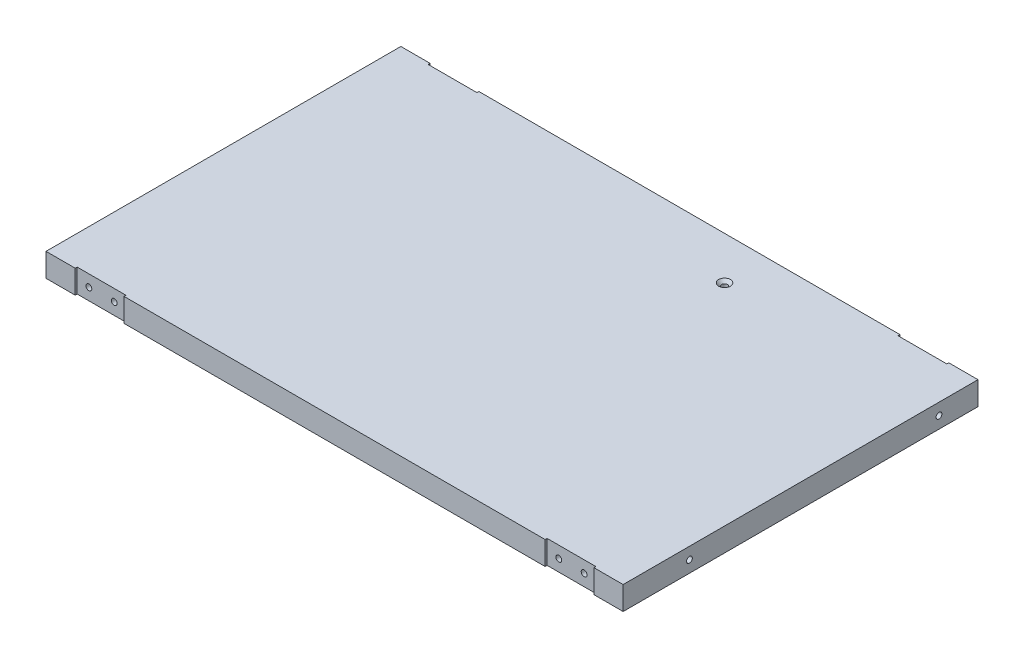
ISO-10303-21;
HEADER;
FILE_DESCRIPTION(('STEP AP214'),'2;1');
FILE_NAME('part.step','',(''),(''),'','','');
FILE_SCHEMA(('AUTOMOTIVE_DESIGN { 1 0 10303 214 1 1 1 1 }'));
ENDSEC;
DATA;
#1=APPLICATION_CONTEXT('core data for automotive mechanical design processes');
#2=APPLICATION_PROTOCOL_DEFINITION('international standard','automotive_design',2000,#1);
#3=PRODUCT_CONTEXT('',#1,'mechanical');
#4=PRODUCT('Part','Part','',(#3));
#5=PRODUCT_RELATED_PRODUCT_CATEGORY('part','',(#4));
#6=PRODUCT_DEFINITION_FORMATION('','',#4);
#7=PRODUCT_DEFINITION_CONTEXT('part definition',#1,'design');
#8=PRODUCT_DEFINITION('design','',#6,#7);
#9=PRODUCT_DEFINITION_SHAPE('','',#8);
#10=(LENGTH_UNIT() NAMED_UNIT(*) SI_UNIT(.MILLI.,.METRE.));
#11=(NAMED_UNIT(*) PLANE_ANGLE_UNIT() SI_UNIT($,.RADIAN.));
#12=(NAMED_UNIT(*) SI_UNIT($,.STERADIAN.) SOLID_ANGLE_UNIT());
#13=UNCERTAINTY_MEASURE_WITH_UNIT(LENGTH_MEASURE(1.E-05),#10,'distance_accuracy_value','');
#14=(GEOMETRIC_REPRESENTATION_CONTEXT(3) GLOBAL_UNCERTAINTY_ASSIGNED_CONTEXT((#13)) GLOBAL_UNIT_ASSIGNED_CONTEXT((#10,
#11,#12)) REPRESENTATION_CONTEXT('',''));
#15=CARTESIAN_POINT('',(0.,0.,0.));
#16=DIRECTION('',(0.,0.,1.));
#17=DIRECTION('',(1.,0.,0.));
#18=AXIS2_PLACEMENT_3D('',#15,#16,#17);
#19=CARTESIAN_POINT('',(0.,12.,0.));
#20=DIRECTION('',(0.,-1.,0.));
#21=DIRECTION('',(0.,0.,-1.));
#22=AXIS2_PLACEMENT_3D('',#19,#20,#21);
#23=PLANE('',#22);
#24=CARTESIAN_POINT('',(188.,12.,-160.));
#25=DIRECTION('',(0.,-1.,0.));
#26=DIRECTION('',(0.,0.,-1.));
#27=AXIS2_PLACEMENT_3D('',#24,#25,#26);
#28=CIRCLE('',#27,2.99999999999999);
#29=CARTESIAN_POINT('',(188.,12.,-163.));
#30=VERTEX_POINT('',#29);
#31=EDGE_CURVE('E325',#30,#30,#28,.T.);
#32=ORIENTED_EDGE('',*,*,#31,.T.);
#33=EDGE_LOOP('',(#32));
#34=FACE_BOUND('',#33,.T.);
#35=DIRECTION('',(0.,0.,-1.));
#36=VECTOR('',#35,1.);
#37=CARTESIAN_POINT('',(281.,12.,-181.));
#38=LINE('',#37,#36);
#39=CARTESIAN_POINT('',(281.,12.,-181.));
#40=VERTEX_POINT('',#39);
#41=CARTESIAN_POINT('',(281.,12.,-182.));
#42=VERTEX_POINT('',#41);
#43=EDGE_CURVE('E192',#40,#42,#38,.T.);
#44=ORIENTED_EDGE('',*,*,#43,.F.);
#45=DIRECTION('',(-1.,0.,0.));
#46=VECTOR('',#45,1.);
#47=CARTESIAN_POINT('',(0.,12.,-181.));
#48=LINE('',#47,#46);
#49=CARTESIAN_POINT('',(256.,12.,-181.));
#50=VERTEX_POINT('',#49);
#51=EDGE_CURVE('E180',#40,#50,#48,.T.);
#52=ORIENTED_EDGE('',*,*,#51,.T.);
#53=DIRECTION('',(0.,0.,-1.));
#54=VECTOR('',#53,1.);
#55=CARTESIAN_POINT('',(256.,12.,-181.));
#56=LINE('',#55,#54);
#57=CARTESIAN_POINT('',(256.,12.,-182.));
#58=VERTEX_POINT('',#57);
#59=EDGE_CURVE('E205',#50,#58,#56,.T.);
#60=ORIENTED_EDGE('',*,*,#59,.T.);
#61=DIRECTION('',(-1.,0.,0.));
#62=VECTOR('',#61,1.);
#63=CARTESIAN_POINT('',(0.,12.,-182.));
#64=LINE('',#63,#62);
#65=CARTESIAN_POINT('',(40.,12.,-182.));
#66=VERTEX_POINT('',#65);
#67=EDGE_CURVE('E57',#58,#66,#64,.T.);
#68=ORIENTED_EDGE('',*,*,#67,.T.);
#69=DIRECTION('',(0.,0.,-1.));
#70=VECTOR('',#69,1.);
#71=CARTESIAN_POINT('',(40.,12.,-181.));
#72=LINE('',#71,#70);
#73=CARTESIAN_POINT('',(40.,12.,-181.));
#74=VERTEX_POINT('',#73);
#75=EDGE_CURVE('E223',#74,#66,#72,.T.);
#76=ORIENTED_EDGE('',*,*,#75,.F.);
#77=DIRECTION('',(-1.,0.,0.));
#78=VECTOR('',#77,1.);
#79=CARTESIAN_POINT('',(0.,12.,-181.));
#80=LINE('',#79,#78);
#81=CARTESIAN_POINT('',(15.,12.,-181.));
#82=VERTEX_POINT('',#81);
#83=EDGE_CURVE('E212',#74,#82,#80,.T.);
#84=ORIENTED_EDGE('',*,*,#83,.T.);
#85=DIRECTION('',(0.,0.,-1.));
#86=VECTOR('',#85,1.);
#87=CARTESIAN_POINT('',(15.,12.,-181.));
#88=LINE('',#87,#86);
#89=CARTESIAN_POINT('',(15.,12.,-182.));
#90=VERTEX_POINT('',#89);
#91=EDGE_CURVE('E234',#82,#90,#88,.T.);
#92=ORIENTED_EDGE('',*,*,#91,.T.);
#93=CARTESIAN_POINT('',(0.,12.,-182.));
#94=VERTEX_POINT('',#93);
#95=EDGE_CURVE('E368',#90,#94,#64,.T.);
#96=ORIENTED_EDGE('',*,*,#95,.T.);
#97=DIRECTION('',(0.,0.,1.));
#98=VECTOR('',#97,1.);
#99=CARTESIAN_POINT('',(0.,12.,0.));
#100=LINE('',#99,#98);
#101=CARTESIAN_POINT('',(0.,12.,0.));
#102=VERTEX_POINT('',#101);
#103=EDGE_CURVE('E357',#94,#102,#100,.T.);
#104=ORIENTED_EDGE('',*,*,#103,.T.);
#105=DIRECTION('',(1.,0.,0.));
#106=VECTOR('',#105,1.);
#107=CARTESIAN_POINT('',(0.,12.,0.));
#108=LINE('',#107,#106);
#109=CARTESIAN_POINT('',(15.,12.,0.));
#110=VERTEX_POINT('',#109);
#111=EDGE_CURVE('E362',#102,#110,#108,.T.);
#112=ORIENTED_EDGE('',*,*,#111,.T.);
#113=DIRECTION('',(0.,0.,1.));
#114=VECTOR('',#113,1.);
#115=CARTESIAN_POINT('',(15.,12.,-1.));
#116=LINE('',#115,#114);
#117=CARTESIAN_POINT('',(15.,12.,-1.));
#118=VERTEX_POINT('',#117);
#119=EDGE_CURVE('E288',#118,#110,#116,.T.);
#120=ORIENTED_EDGE('',*,*,#119,.F.);
#121=DIRECTION('',(-1.,0.,0.));
#122=VECTOR('',#121,1.);
#123=CARTESIAN_POINT('',(15.,12.,-1.));
#124=LINE('',#123,#122);
#125=CARTESIAN_POINT('',(40.,12.,-1.));
#126=VERTEX_POINT('',#125);
#127=EDGE_CURVE('E282',#126,#118,#124,.T.);
#128=ORIENTED_EDGE('',*,*,#127,.F.);
#129=DIRECTION('',(0.,0.,1.));
#130=VECTOR('',#129,1.);
#131=CARTESIAN_POINT('',(40.,12.,-1.));
#132=LINE('',#131,#130);
#133=CARTESIAN_POINT('',(40.,12.,0.));
#134=VERTEX_POINT('',#133);
#135=EDGE_CURVE('E291',#126,#134,#132,.T.);
#136=ORIENTED_EDGE('',*,*,#135,.T.);
#137=CARTESIAN_POINT('',(256.,12.,0.));
#138=VERTEX_POINT('',#137);
#139=EDGE_CURVE('E366',#134,#138,#108,.T.);
#140=ORIENTED_EDGE('',*,*,#139,.T.);
#141=DIRECTION('',(0.,0.,1.));
#142=VECTOR('',#141,1.);
#143=CARTESIAN_POINT('',(256.,12.,-1.));
#144=LINE('',#143,#142);
#145=CARTESIAN_POINT('',(256.,12.,-1.));
#146=VERTEX_POINT('',#145);
#147=EDGE_CURVE('E264',#146,#138,#144,.T.);
#148=ORIENTED_EDGE('',*,*,#147,.F.);
#149=DIRECTION('',(-1.,0.,0.));
#150=VECTOR('',#149,1.);
#151=CARTESIAN_POINT('',(281.,12.,-1.));
#152=LINE('',#151,#150);
#153=CARTESIAN_POINT('',(281.,12.,-1.));
#154=VERTEX_POINT('',#153);
#155=EDGE_CURVE('E245',#154,#146,#152,.T.);
#156=ORIENTED_EDGE('',*,*,#155,.F.);
#157=DIRECTION('',(0.,0.,1.));
#158=VECTOR('',#157,1.);
#159=CARTESIAN_POINT('',(281.,12.,-1.));
#160=LINE('',#159,#158);
#161=CARTESIAN_POINT('',(281.,12.,0.));
#162=VERTEX_POINT('',#161);
#163=EDGE_CURVE('E255',#154,#162,#160,.T.);
#164=ORIENTED_EDGE('',*,*,#163,.T.);
#165=CARTESIAN_POINT('',(296.,12.,0.));
#166=VERTEX_POINT('',#165);
#167=EDGE_CURVE('E360',#162,#166,#108,.T.);
#168=ORIENTED_EDGE('',*,*,#167,.T.);
#169=DIRECTION('',(0.,0.,-1.));
#170=VECTOR('',#169,1.);
#171=CARTESIAN_POINT('',(296.,12.,0.));
#172=LINE('',#171,#170);
#173=CARTESIAN_POINT('',(296.,12.,-182.));
#174=VERTEX_POINT('',#173);
#175=EDGE_CURVE('E365',#166,#174,#172,.T.);
#176=ORIENTED_EDGE('',*,*,#175,.T.);
#177=EDGE_CURVE('E369',#174,#42,#64,.T.);
#178=ORIENTED_EDGE('',*,*,#177,.T.);
#179=EDGE_LOOP('',(#44,#52,#60,#68,#76,#84,#92,#96,#104,#112,#120,#128,#136,#140,#148,#156,#164,
#168,#176,#178));
#180=FACE_BOUND('',#179,.T.);
#181=ADVANCED_FACE('F32',(#34,#180),#23,.F.);
#182=CARTESIAN_POINT('',(0.,0.,0.));
#183=DIRECTION('',(0.,-1.,0.));
#184=DIRECTION('',(0.,0.,-1.));
#185=AXIS2_PLACEMENT_3D('',#182,#183,#184);
#186=PLANE('',#185);
#187=CARTESIAN_POINT('',(188.,0.,-160.));
#188=DIRECTION('',(0.,1.,0.));
#189=DIRECTION('',(0.,0.,1.));
#190=AXIS2_PLACEMENT_3D('',#187,#188,#189);
#191=CIRCLE('',#190,1.5);
#192=CARTESIAN_POINT('',(188.,0.,-158.5));
#193=VERTEX_POINT('',#192);
#194=EDGE_CURVE('E351',#193,#193,#191,.T.);
#195=ORIENTED_EDGE('',*,*,#194,.T.);
#196=EDGE_LOOP('',(#195));
#197=FACE_BOUND('',#196,.T.);
#198=DIRECTION('',(1.,0.,0.));
#199=VECTOR('',#198,1.);
#200=CARTESIAN_POINT('',(0.,0.,-181.));
#201=LINE('',#200,#199);
#202=CARTESIAN_POINT('',(256.,0.,-181.));
#203=VERTEX_POINT('',#202);
#204=CARTESIAN_POINT('',(281.,0.,-181.));
#205=VERTEX_POINT('',#204);
#206=EDGE_CURVE('E178',#203,#205,#201,.T.);
#207=ORIENTED_EDGE('',*,*,#206,.T.);
#208=DIRECTION('',(0.,0.,-1.));
#209=VECTOR('',#208,1.);
#210=CARTESIAN_POINT('',(281.,0.,-181.));
#211=LINE('',#210,#209);
#212=CARTESIAN_POINT('',(281.,0.,-182.));
#213=VERTEX_POINT('',#212);
#214=EDGE_CURVE('E185',#205,#213,#211,.T.);
#215=ORIENTED_EDGE('',*,*,#214,.T.);
#216=DIRECTION('',(-1.,0.,0.));
#217=VECTOR('',#216,1.);
#218=CARTESIAN_POINT('',(0.,0.,-182.));
#219=LINE('',#218,#217);
#220=CARTESIAN_POINT('',(296.,0.,-182.));
#221=VERTEX_POINT('',#220);
#222=EDGE_CURVE('E361',#221,#213,#219,.T.);
#223=ORIENTED_EDGE('',*,*,#222,.F.);
#224=DIRECTION('',(0.,0.,-1.));
#225=VECTOR('',#224,1.);
#226=CARTESIAN_POINT('',(296.,0.,0.));
#227=LINE('',#226,#225);
#228=CARTESIAN_POINT('',(296.,0.,0.));
#229=VERTEX_POINT('',#228);
#230=EDGE_CURVE('E379',#229,#221,#227,.T.);
#231=ORIENTED_EDGE('',*,*,#230,.F.);
#232=DIRECTION('',(1.,0.,0.));
#233=VECTOR('',#232,1.);
#234=CARTESIAN_POINT('',(0.,0.,0.));
#235=LINE('',#234,#233);
#236=CARTESIAN_POINT('',(281.,0.,0.));
#237=VERTEX_POINT('',#236);
#238=EDGE_CURVE('E375',#237,#229,#235,.T.);
#239=ORIENTED_EDGE('',*,*,#238,.F.);
#240=DIRECTION('',(0.,0.,1.));
#241=VECTOR('',#240,1.);
#242=CARTESIAN_POINT('',(281.,0.,-1.));
#243=LINE('',#242,#241);
#244=CARTESIAN_POINT('',(281.,0.,-1.));
#245=VERTEX_POINT('',#244);
#246=EDGE_CURVE('E258',#245,#237,#243,.T.);
#247=ORIENTED_EDGE('',*,*,#246,.F.);
#248=DIRECTION('',(1.,0.,0.));
#249=VECTOR('',#248,1.);
#250=CARTESIAN_POINT('',(281.,0.,-1.));
#251=LINE('',#250,#249);
#252=CARTESIAN_POINT('',(256.,0.,-1.));
#253=VERTEX_POINT('',#252);
#254=EDGE_CURVE('E252',#253,#245,#251,.T.);
#255=ORIENTED_EDGE('',*,*,#254,.F.);
#256=DIRECTION('',(0.,0.,1.));
#257=VECTOR('',#256,1.);
#258=CARTESIAN_POINT('',(256.,0.,-1.));
#259=LINE('',#258,#257);
#260=CARTESIAN_POINT('',(256.,0.,0.));
#261=VERTEX_POINT('',#260);
#262=EDGE_CURVE('E261',#253,#261,#259,.T.);
#263=ORIENTED_EDGE('',*,*,#262,.T.);
#264=CARTESIAN_POINT('',(40.,0.,0.));
#265=VERTEX_POINT('',#264);
#266=EDGE_CURVE('E380',#265,#261,#235,.T.);
#267=ORIENTED_EDGE('',*,*,#266,.F.);
#268=DIRECTION('',(0.,0.,1.));
#269=VECTOR('',#268,1.);
#270=CARTESIAN_POINT('',(40.,0.,-1.));
#271=LINE('',#270,#269);
#272=CARTESIAN_POINT('',(40.,0.,-1.));
#273=VERTEX_POINT('',#272);
#274=EDGE_CURVE('E294',#273,#265,#271,.T.);
#275=ORIENTED_EDGE('',*,*,#274,.F.);
#276=DIRECTION('',(1.,0.,0.));
#277=VECTOR('',#276,1.);
#278=CARTESIAN_POINT('',(15.,0.,-1.));
#279=LINE('',#278,#277);
#280=CARTESIAN_POINT('',(15.,0.,-1.));
#281=VERTEX_POINT('',#280);
#282=EDGE_CURVE('E275',#281,#273,#279,.T.);
#283=ORIENTED_EDGE('',*,*,#282,.F.);
#284=DIRECTION('',(0.,0.,1.));
#285=VECTOR('',#284,1.);
#286=CARTESIAN_POINT('',(15.,0.,-1.));
#287=LINE('',#286,#285);
#288=CARTESIAN_POINT('',(15.,0.,0.));
#289=VERTEX_POINT('',#288);
#290=EDGE_CURVE('E285',#281,#289,#287,.T.);
#291=ORIENTED_EDGE('',*,*,#290,.T.);
#292=CARTESIAN_POINT('',(0.,0.,0.));
#293=VERTEX_POINT('',#292);
#294=EDGE_CURVE('E376',#293,#289,#235,.T.);
#295=ORIENTED_EDGE('',*,*,#294,.F.);
#296=DIRECTION('',(0.,0.,1.));
#297=VECTOR('',#296,1.);
#298=CARTESIAN_POINT('',(0.,0.,0.));
#299=LINE('',#298,#297);
#300=CARTESIAN_POINT('',(0.,0.,-182.));
#301=VERTEX_POINT('',#300);
#302=EDGE_CURVE('E356',#301,#293,#299,.T.);
#303=ORIENTED_EDGE('',*,*,#302,.F.);
#304=CARTESIAN_POINT('',(15.,0.,-182.));
#305=VERTEX_POINT('',#304);
#306=EDGE_CURVE('E382',#305,#301,#219,.T.);
#307=ORIENTED_EDGE('',*,*,#306,.F.);
#308=DIRECTION('',(0.,0.,-1.));
#309=VECTOR('',#308,1.);
#310=CARTESIAN_POINT('',(15.,0.,-181.));
#311=LINE('',#310,#309);
#312=CARTESIAN_POINT('',(15.,0.,-181.));
#313=VERTEX_POINT('',#312);
#314=EDGE_CURVE('E232',#313,#305,#311,.T.);
#315=ORIENTED_EDGE('',*,*,#314,.F.);
#316=DIRECTION('',(1.,0.,0.));
#317=VECTOR('',#316,1.);
#318=CARTESIAN_POINT('',(0.,0.,-181.));
#319=LINE('',#318,#317);
#320=CARTESIAN_POINT('',(40.,0.,-181.));
#321=VERTEX_POINT('',#320);
#322=EDGE_CURVE('E218',#313,#321,#319,.T.);
#323=ORIENTED_EDGE('',*,*,#322,.T.);
#324=DIRECTION('',(0.,0.,-1.));
#325=VECTOR('',#324,1.);
#326=CARTESIAN_POINT('',(40.,0.,-181.));
#327=LINE('',#326,#325);
#328=CARTESIAN_POINT('',(40.,0.,-182.));
#329=VERTEX_POINT('',#328);
#330=EDGE_CURVE('E229',#321,#329,#327,.T.);
#331=ORIENTED_EDGE('',*,*,#330,.T.);
#332=CARTESIAN_POINT('',(256.,0.,-182.));
#333=VERTEX_POINT('',#332);
#334=EDGE_CURVE('E384',#333,#329,#219,.T.);
#335=ORIENTED_EDGE('',*,*,#334,.F.);
#336=DIRECTION('',(0.,0.,-1.));
#337=VECTOR('',#336,1.);
#338=CARTESIAN_POINT('',(256.,0.,-181.));
#339=LINE('',#338,#337);
#340=EDGE_CURVE('E49',#203,#333,#339,.T.);
#341=ORIENTED_EDGE('',*,*,#340,.F.);
#342=EDGE_LOOP('',(#207,#215,#223,#231,#239,#247,#255,#263,#267,#275,#283,#291,#295,#303,#307,
#315,#323,#331,#335,#341));
#343=FACE_BOUND('',#342,.T.);
#344=ADVANCED_FACE('F194',(#197,#343),#186,.T.);
#345=CARTESIAN_POINT('',(0.,12.,-182.));
#346=DIRECTION('',(0.,0.,1.));
#347=DIRECTION('',(1.,0.,0.));
#348=AXIS2_PLACEMENT_3D('',#345,#346,#347);
#349=PLANE('',#348);
#350=DIRECTION('',(0.,1.,0.));
#351=VECTOR('',#350,1.);
#352=CARTESIAN_POINT('',(281.,12.,-182.));
#353=LINE('',#352,#351);
#354=EDGE_CURVE('E188',#213,#42,#353,.T.);
#355=ORIENTED_EDGE('',*,*,#354,.T.);
#356=ORIENTED_EDGE('',*,*,#177,.F.);
#357=DIRECTION('',(0.,-1.,0.));
#358=VECTOR('',#357,1.);
#359=CARTESIAN_POINT('',(296.,12.,-182.));
#360=LINE('',#359,#358);
#361=EDGE_CURVE('E387',#174,#221,#360,.T.);
#362=ORIENTED_EDGE('',*,*,#361,.T.);
#363=ORIENTED_EDGE('',*,*,#222,.T.);
#364=EDGE_LOOP('',(#355,#356,#362,#363));
#365=FACE_BOUND('',#364,.T.);
#366=ADVANCED_FACE('F426',(#365),#349,.F.);
#367=DIRECTION('',(0.,-1.,0.));
#368=VECTOR('',#367,1.);
#369=CARTESIAN_POINT('',(256.,12.,-182.));
#370=LINE('',#369,#368);
#371=EDGE_CURVE('E196',#58,#333,#370,.T.);
#372=ORIENTED_EDGE('',*,*,#371,.T.);
#373=ORIENTED_EDGE('',*,*,#334,.T.);
#374=DIRECTION('',(0.,1.,0.));
#375=VECTOR('',#374,1.);
#376=CARTESIAN_POINT('',(40.,12.,-182.));
#377=LINE('',#376,#375);
#378=EDGE_CURVE('E216',#329,#66,#377,.T.);
#379=ORIENTED_EDGE('',*,*,#378,.T.);
#380=ORIENTED_EDGE('',*,*,#67,.F.);
#381=EDGE_LOOP('',(#372,#373,#379,#380));
#382=FACE_BOUND('',#381,.T.);
#383=ADVANCED_FACE('F437',(#382),#349,.F.);
#384=DIRECTION('',(0.,-1.,0.));
#385=VECTOR('',#384,1.);
#386=CARTESIAN_POINT('',(15.,12.,-182.));
#387=LINE('',#386,#385);
#388=EDGE_CURVE('E211',#90,#305,#387,.T.);
#389=ORIENTED_EDGE('',*,*,#388,.T.);
#390=ORIENTED_EDGE('',*,*,#306,.T.);
#391=DIRECTION('',(0.,-1.,0.));
#392=VECTOR('',#391,1.);
#393=CARTESIAN_POINT('',(0.,12.,-182.));
#394=LINE('',#393,#392);
#395=EDGE_CURVE('E372',#94,#301,#394,.T.);
#396=ORIENTED_EDGE('',*,*,#395,.F.);
#397=ORIENTED_EDGE('',*,*,#95,.F.);
#398=EDGE_LOOP('',(#389,#390,#396,#397));
#399=FACE_BOUND('',#398,.T.);
#400=ADVANCED_FACE('F433',(#399),#349,.F.);
#401=CARTESIAN_POINT('',(0.,12.,0.));
#402=DIRECTION('',(0.,0.,-1.));
#403=DIRECTION('',(-1.,0.,0.));
#404=AXIS2_PLACEMENT_3D('',#401,#402,#403);
#405=PLANE('',#404);
#406=ORIENTED_EDGE('',*,*,#167,.F.);
#407=DIRECTION('',(0.,1.,0.));
#408=VECTOR('',#407,1.);
#409=CARTESIAN_POINT('',(281.,12.,0.));
#410=LINE('',#409,#408);
#411=EDGE_CURVE('E241',#237,#162,#410,.T.);
#412=ORIENTED_EDGE('',*,*,#411,.F.);
#413=ORIENTED_EDGE('',*,*,#238,.T.);
#414=DIRECTION('',(0.,-1.,0.));
#415=VECTOR('',#414,1.);
#416=CARTESIAN_POINT('',(296.,12.,0.));
#417=LINE('',#416,#415);
#418=EDGE_CURVE('E41',#166,#229,#417,.T.);
#419=ORIENTED_EDGE('',*,*,#418,.F.);
#420=EDGE_LOOP('',(#406,#412,#413,#419));
#421=FACE_BOUND('',#420,.T.);
#422=ADVANCED_FACE('F436',(#421),#405,.F.);
#423=ORIENTED_EDGE('',*,*,#294,.T.);
#424=DIRECTION('',(0.,-1.,0.));
#425=VECTOR('',#424,1.);
#426=CARTESIAN_POINT('',(15.,12.,0.));
#427=LINE('',#426,#425);
#428=EDGE_CURVE('E271',#110,#289,#427,.T.);
#429=ORIENTED_EDGE('',*,*,#428,.F.);
#430=ORIENTED_EDGE('',*,*,#111,.F.);
#431=DIRECTION('',(0.,-1.,0.));
#432=VECTOR('',#431,1.);
#433=CARTESIAN_POINT('',(0.,12.,0.));
#434=LINE('',#433,#432);
#435=EDGE_CURVE('E11',#102,#293,#434,.T.);
#436=ORIENTED_EDGE('',*,*,#435,.T.);
#437=EDGE_LOOP('',(#423,#429,#430,#436));
#438=FACE_BOUND('',#437,.T.);
#439=ADVANCED_FACE('F446',(#438),#405,.F.);
#440=CARTESIAN_POINT('',(188.,12.,-160.));
#441=DIRECTION('',(0.,-1.,0.));
#442=DIRECTION('',(0.,0.,-1.));
#443=AXIS2_PLACEMENT_3D('',#440,#441,#442);
#444=CYLINDRICAL_SURFACE('',#443,1.5);
#445=ORIENTED_EDGE('',*,*,#194,.F.);
#446=EDGE_LOOP('',(#445));
#447=FACE_BOUND('',#446,.T.);
#448=CARTESIAN_POINT('',(188.,10.5,-160.));
#449=DIRECTION('',(0.,1.,0.));
#450=DIRECTION('',(0.,0.,1.));
#451=AXIS2_PLACEMENT_3D('',#448,#449,#450);
#452=CIRCLE('',#451,1.5);
#453=CARTESIAN_POINT('',(188.,10.5,-158.5));
#454=VERTEX_POINT('',#453);
#455=EDGE_CURVE('E328',#454,#454,#452,.T.);
#456=ORIENTED_EDGE('',*,*,#455,.T.);
#457=EDGE_LOOP('',(#456));
#458=FACE_BOUND('',#457,.T.);
#459=ADVANCED_FACE('F430',(#447,#458),#444,.F.);
#460=CARTESIAN_POINT('',(0.,12.,0.));
#461=DIRECTION('',(1.,0.,0.));
#462=DIRECTION('',(0.,0.,-1.));
#463=AXIS2_PLACEMENT_3D('',#460,#461,#462);
#464=PLANE('',#463);
#465=CARTESIAN_POINT('',(0.,6.,-34.));
#466=DIRECTION('',(1.,0.,0.));
#467=DIRECTION('',(0.,0.,-1.));
#468=AXIS2_PLACEMENT_3D('',#465,#466,#467);
#469=CIRCLE('',#468,1.5);
#470=CARTESIAN_POINT('',(0.,6.,-35.5));
#471=VERTEX_POINT('',#470);
#472=EDGE_CURVE('E339',#471,#471,#469,.T.);
#473=ORIENTED_EDGE('',*,*,#472,.T.);
#474=EDGE_LOOP('',(#473));
#475=FACE_BOUND('',#474,.T.);
#476=CARTESIAN_POINT('',(0.,6.,-162.));
#477=DIRECTION('',(1.,0.,0.));
#478=DIRECTION('',(0.,0.,-1.));
#479=AXIS2_PLACEMENT_3D('',#476,#477,#478);
#480=CIRCLE('',#479,1.5);
#481=CARTESIAN_POINT('',(0.,6.,-163.5));
#482=VERTEX_POINT('',#481);
#483=EDGE_CURVE('E345',#482,#482,#480,.T.);
#484=ORIENTED_EDGE('',*,*,#483,.T.);
#485=EDGE_LOOP('',(#484));
#486=FACE_BOUND('',#485,.T.);
#487=ORIENTED_EDGE('',*,*,#302,.T.);
#488=ORIENTED_EDGE('',*,*,#435,.F.);
#489=ORIENTED_EDGE('',*,*,#103,.F.);
#490=ORIENTED_EDGE('',*,*,#395,.T.);
#491=EDGE_LOOP('',(#487,#488,#489,#490));
#492=FACE_BOUND('',#491,.T.);
#493=ADVANCED_FACE('F34',(#475,#486,#492),#464,.F.);
#494=ORIENTED_EDGE('',*,*,#266,.T.);
#495=DIRECTION('',(0.,-1.,0.));
#496=VECTOR('',#495,1.);
#497=CARTESIAN_POINT('',(256.,12.,0.));
#498=LINE('',#497,#496);
#499=EDGE_CURVE('E246',#138,#261,#498,.T.);
#500=ORIENTED_EDGE('',*,*,#499,.F.);
#501=ORIENTED_EDGE('',*,*,#139,.F.);
#502=DIRECTION('',(0.,1.,0.));
#503=VECTOR('',#502,1.);
#504=CARTESIAN_POINT('',(40.,12.,0.));
#505=LINE('',#504,#503);
#506=EDGE_CURVE('E276',#265,#134,#505,.T.);
#507=ORIENTED_EDGE('',*,*,#506,.F.);
#508=EDGE_LOOP('',(#494,#500,#501,#507));
#509=FACE_BOUND('',#508,.T.);
#510=ADVANCED_FACE('F442',(#509),#405,.F.);
#511=CARTESIAN_POINT('',(296.,12.,0.));
#512=DIRECTION('',(-1.,0.,0.));
#513=DIRECTION('',(0.,0.,1.));
#514=AXIS2_PLACEMENT_3D('',#511,#512,#513);
#515=PLANE('',#514);
#516=CARTESIAN_POINT('',(296.,6.,-34.));
#517=DIRECTION('',(-1.,0.,0.));
#518=DIRECTION('',(0.,0.,1.));
#519=AXIS2_PLACEMENT_3D('',#516,#517,#518);
#520=CIRCLE('',#519,1.5);
#521=CARTESIAN_POINT('',(296.,6.,-32.5));
#522=VERTEX_POINT('',#521);
#523=EDGE_CURVE('E333',#522,#522,#520,.T.);
#524=ORIENTED_EDGE('',*,*,#523,.T.);
#525=EDGE_LOOP('',(#524));
#526=FACE_BOUND('',#525,.T.);
#527=CARTESIAN_POINT('',(296.,6.,-162.));
#528=DIRECTION('',(-1.,0.,0.));
#529=DIRECTION('',(0.,0.,1.));
#530=AXIS2_PLACEMENT_3D('',#527,#528,#529);
#531=CIRCLE('',#530,1.5);
#532=CARTESIAN_POINT('',(296.,6.,-160.5));
#533=VERTEX_POINT('',#532);
#534=EDGE_CURVE('E332',#533,#533,#531,.T.);
#535=ORIENTED_EDGE('',*,*,#534,.T.);
#536=EDGE_LOOP('',(#535));
#537=FACE_BOUND('',#536,.T.);
#538=ORIENTED_EDGE('',*,*,#230,.T.);
#539=ORIENTED_EDGE('',*,*,#361,.F.);
#540=ORIENTED_EDGE('',*,*,#175,.F.);
#541=ORIENTED_EDGE('',*,*,#418,.T.);
#542=EDGE_LOOP('',(#538,#539,#540,#541));
#543=FACE_BOUND('',#542,.T.);
#544=ADVANCED_FACE('F439',(#526,#537,#543),#515,.F.);
#545=CARTESIAN_POINT('',(20.,6.,-162.));
#546=DIRECTION('',(-1.,0.,0.));
#547=DIRECTION('',(0.,0.,1.));
#548=AXIS2_PLACEMENT_3D('',#545,#546,#547);
#549=CYLINDRICAL_SURFACE('',#548,1.5);
#550=CARTESIAN_POINT('',(20.,6.,-162.));
#551=DIRECTION('',(1.,0.,0.));
#552=DIRECTION('',(0.,0.,-1.));
#553=AXIS2_PLACEMENT_3D('',#550,#551,#552);
#554=CIRCLE('',#553,1.5);
#555=CARTESIAN_POINT('',(20.,6.,-163.5));
#556=VERTEX_POINT('',#555);
#557=EDGE_CURVE('E348',#556,#556,#554,.T.);
#558=ORIENTED_EDGE('',*,*,#557,.T.);
#559=EDGE_LOOP('',(#558));
#560=FACE_BOUND('',#559,.T.);
#561=ORIENTED_EDGE('',*,*,#483,.F.);
#562=EDGE_LOOP('',(#561));
#563=FACE_BOUND('',#562,.T.);
#564=ADVANCED_FACE('F441',(#560,#563),#549,.F.);
#565=CARTESIAN_POINT('',(20.,6.,-162.));
#566=DIRECTION('',(1.,0.,0.));
#567=DIRECTION('',(0.,0.,-1.));
#568=AXIS2_PLACEMENT_3D('',#565,#566,#567);
#569=PLANE('',#568);
#570=ORIENTED_EDGE('',*,*,#557,.F.);
#571=EDGE_LOOP('',(#570));
#572=FACE_BOUND('',#571,.T.);
#573=ADVANCED_FACE('F825',(#572),#569,.F.);
#574=CARTESIAN_POINT('',(20.,6.,-34.));
#575=DIRECTION('',(-1.,0.,0.));
#576=DIRECTION('',(0.,0.,1.));
#577=AXIS2_PLACEMENT_3D('',#574,#575,#576);
#578=CYLINDRICAL_SURFACE('',#577,1.5);
#579=CARTESIAN_POINT('',(20.,6.,-34.));
#580=DIRECTION('',(1.,0.,0.));
#581=DIRECTION('',(0.,0.,-1.));
#582=AXIS2_PLACEMENT_3D('',#579,#580,#581);
#583=CIRCLE('',#582,1.5);
#584=CARTESIAN_POINT('',(20.,6.,-35.5));
#585=VERTEX_POINT('',#584);
#586=EDGE_CURVE('E342',#585,#585,#583,.T.);
#587=ORIENTED_EDGE('',*,*,#586,.T.);
#588=EDGE_LOOP('',(#587));
#589=FACE_BOUND('',#588,.T.);
#590=ORIENTED_EDGE('',*,*,#472,.F.);
#591=EDGE_LOOP('',(#590));
#592=FACE_BOUND('',#591,.T.);
#593=ADVANCED_FACE('F815',(#589,#592),#578,.F.);
#594=CARTESIAN_POINT('',(20.,6.,-34.));
#595=DIRECTION('',(1.,0.,0.));
#596=DIRECTION('',(0.,0.,-1.));
#597=AXIS2_PLACEMENT_3D('',#594,#595,#596);
#598=PLANE('',#597);
#599=ORIENTED_EDGE('',*,*,#586,.F.);
#600=EDGE_LOOP('',(#599));
#601=FACE_BOUND('',#600,.T.);
#602=ADVANCED_FACE('F796',(#601),#598,.F.);
#603=CARTESIAN_POINT('',(276.,6.,-162.));
#604=DIRECTION('',(1.,0.,0.));
#605=DIRECTION('',(0.,0.,-1.));
#606=AXIS2_PLACEMENT_3D('',#603,#604,#605);
#607=CYLINDRICAL_SURFACE('',#606,1.5);
#608=CARTESIAN_POINT('',(276.,6.,-162.));
#609=DIRECTION('',(-1.,0.,0.));
#610=DIRECTION('',(0.,0.,1.));
#611=AXIS2_PLACEMENT_3D('',#608,#609,#610);
#612=CIRCLE('',#611,1.5);
#613=CARTESIAN_POINT('',(276.,6.,-160.5));
#614=VERTEX_POINT('',#613);
#615=EDGE_CURVE('E336',#614,#614,#612,.T.);
#616=ORIENTED_EDGE('',*,*,#615,.T.);
#617=EDGE_LOOP('',(#616));
#618=FACE_BOUND('',#617,.T.);
#619=ORIENTED_EDGE('',*,*,#534,.F.);
#620=EDGE_LOOP('',(#619));
#621=FACE_BOUND('',#620,.T.);
#622=ADVANCED_FACE('F786',(#618,#621),#607,.F.);
#623=CARTESIAN_POINT('',(276.,6.,-162.));
#624=DIRECTION('',(-1.,0.,0.));
#625=DIRECTION('',(0.,0.,1.));
#626=AXIS2_PLACEMENT_3D('',#623,#624,#625);
#627=PLANE('',#626);
#628=ORIENTED_EDGE('',*,*,#615,.F.);
#629=EDGE_LOOP('',(#628));
#630=FACE_BOUND('',#629,.T.);
#631=ADVANCED_FACE('F776',(#630),#627,.F.);
#632=CARTESIAN_POINT('',(276.,6.,-34.));
#633=DIRECTION('',(1.,0.,0.));
#634=DIRECTION('',(0.,0.,-1.));
#635=AXIS2_PLACEMENT_3D('',#632,#633,#634);
#636=CYLINDRICAL_SURFACE('',#635,1.5);
#637=CARTESIAN_POINT('',(276.,6.,-34.));
#638=DIRECTION('',(-1.,0.,0.));
#639=DIRECTION('',(0.,0.,1.));
#640=AXIS2_PLACEMENT_3D('',#637,#638,#639);
#641=CIRCLE('',#640,1.5);
#642=CARTESIAN_POINT('',(276.,6.,-32.5));
#643=VERTEX_POINT('',#642);
#644=EDGE_CURVE('E329',#643,#643,#641,.T.);
#645=ORIENTED_EDGE('',*,*,#644,.T.);
#646=EDGE_LOOP('',(#645));
#647=FACE_BOUND('',#646,.T.);
#648=ORIENTED_EDGE('',*,*,#523,.F.);
#649=EDGE_LOOP('',(#648));
#650=FACE_BOUND('',#649,.T.);
#651=ADVANCED_FACE('F766',(#647,#650),#636,.F.);
#652=CARTESIAN_POINT('',(276.,6.,-34.));
#653=DIRECTION('',(-1.,0.,0.));
#654=DIRECTION('',(0.,0.,1.));
#655=AXIS2_PLACEMENT_3D('',#652,#653,#654);
#656=PLANE('',#655);
#657=ORIENTED_EDGE('',*,*,#644,.F.);
#658=EDGE_LOOP('',(#657));
#659=FACE_BOUND('',#658,.T.);
#660=ADVANCED_FACE('F750',(#659),#656,.F.);
#661=CARTESIAN_POINT('',(188.,12.,-160.));
#662=DIRECTION('',(0.,1.,0.));
#663=DIRECTION('',(0.,0.,-1.));
#664=AXIS2_PLACEMENT_3D('',#661,#662,#663);
#665=CONICAL_SURFACE('',#664,2.99999999999999,0.78539816339745);
#666=ORIENTED_EDGE('',*,*,#455,.F.);
#667=EDGE_LOOP('',(#666));
#668=FACE_BOUND('',#667,.T.);
#669=ORIENTED_EDGE('',*,*,#31,.F.);
#670=EDGE_LOOP('',(#669));
#671=FACE_BOUND('',#670,.T.);
#672=ADVANCED_FACE('F517',(#668,#671),#665,.F.);
#673=CARTESIAN_POINT('',(0.,0.,-1.));
#674=DIRECTION('',(0.,0.,1.));
#675=DIRECTION('',(1.,0.,0.));
#676=AXIS2_PLACEMENT_3D('',#673,#674,#675);
#677=PLANE('',#676);
#678=DIRECTION('',(0.,-1.,0.));
#679=VECTOR('',#678,1.);
#680=CARTESIAN_POINT('',(15.,12.,-1.));
#681=LINE('',#680,#679);
#682=EDGE_CURVE('E272',#118,#281,#681,.T.);
#683=ORIENTED_EDGE('',*,*,#682,.T.);
#684=ORIENTED_EDGE('',*,*,#282,.T.);
#685=DIRECTION('',(0.,1.,0.));
#686=VECTOR('',#685,1.);
#687=CARTESIAN_POINT('',(40.,12.,-1.));
#688=LINE('',#687,#686);
#689=EDGE_CURVE('E279',#273,#126,#688,.T.);
#690=ORIENTED_EDGE('',*,*,#689,.T.);
#691=ORIENTED_EDGE('',*,*,#127,.T.);
#692=EDGE_LOOP('',(#683,#684,#690,#691));
#693=FACE_BOUND('',#692,.T.);
#694=CARTESIAN_POINT('',(34.,6.,-0.999999999999999));
#695=DIRECTION('',(0.,0.,1.));
#696=DIRECTION('',(1.,0.,0.));
#697=AXIS2_PLACEMENT_3D('',#694,#695,#696);
#698=CIRCLE('',#697,1.5);
#699=CARTESIAN_POINT('',(35.5,6.,-0.999999999999999));
#700=VERTEX_POINT('',#699);
#701=EDGE_CURVE('E290',#700,#700,#698,.F.);
#702=ORIENTED_EDGE('',*,*,#701,.T.);
#703=EDGE_LOOP('',(#702));
#704=FACE_BOUND('',#703,.T.);
#705=CARTESIAN_POINT('',(21.,6.,-0.999999999999999));
#706=DIRECTION('',(0.,0.,1.));
#707=DIRECTION('',(1.,0.,0.));
#708=AXIS2_PLACEMENT_3D('',#705,#706,#707);
#709=CIRCLE('',#708,1.5);
#710=CARTESIAN_POINT('',(22.5,6.,-0.999999999999999));
#711=VERTEX_POINT('',#710);
#712=EDGE_CURVE('E298',#711,#711,#709,.F.);
#713=ORIENTED_EDGE('',*,*,#712,.T.);
#714=EDGE_LOOP('',(#713));
#715=FACE_BOUND('',#714,.T.);
#716=ADVANCED_FACE('F469',(#693,#704,#715),#677,.T.);
#717=CARTESIAN_POINT('',(15.,12.,-1.));
#718=DIRECTION('',(-1.,0.,0.));
#719=DIRECTION('',(0.,-1.,0.));
#720=AXIS2_PLACEMENT_3D('',#717,#718,#719);
#721=PLANE('',#720);
#722=ORIENTED_EDGE('',*,*,#428,.T.);
#723=ORIENTED_EDGE('',*,*,#290,.F.);
#724=ORIENTED_EDGE('',*,*,#682,.F.);
#725=ORIENTED_EDGE('',*,*,#119,.T.);
#726=EDGE_LOOP('',(#722,#723,#724,#725));
#727=FACE_BOUND('',#726,.T.);
#728=ADVANCED_FACE('F467',(#727),#721,.F.);
#729=CARTESIAN_POINT('',(40.,12.,-1.));
#730=DIRECTION('',(1.,0.,0.));
#731=DIRECTION('',(0.,0.,-1.));
#732=AXIS2_PLACEMENT_3D('',#729,#730,#731);
#733=PLANE('',#732);
#734=ORIENTED_EDGE('',*,*,#506,.T.);
#735=ORIENTED_EDGE('',*,*,#135,.F.);
#736=ORIENTED_EDGE('',*,*,#689,.F.);
#737=ORIENTED_EDGE('',*,*,#274,.T.);
#738=EDGE_LOOP('',(#734,#735,#736,#737));
#739=FACE_BOUND('',#738,.T.);
#740=ADVANCED_FACE('F518',(#739),#733,.F.);
#741=CARTESIAN_POINT('',(21.,6.,-10.));
#742=DIRECTION('',(0.,0.,1.));
#743=DIRECTION('',(1.,0.,0.));
#744=AXIS2_PLACEMENT_3D('',#741,#742,#743);
#745=PLANE('',#744);
#746=CARTESIAN_POINT('',(21.,6.,-10.));
#747=DIRECTION('',(0.,0.,1.));
#748=DIRECTION('',(1.,0.,0.));
#749=AXIS2_PLACEMENT_3D('',#746,#747,#748);
#750=CIRCLE('',#749,1.5);
#751=CARTESIAN_POINT('',(22.5,6.,-10.));
#752=VERTEX_POINT('',#751);
#753=EDGE_CURVE('E305',#752,#752,#750,.T.);
#754=ORIENTED_EDGE('',*,*,#753,.T.);
#755=EDGE_LOOP('',(#754));
#756=FACE_BOUND('',#755,.T.);
#757=ADVANCED_FACE('F521',(#756),#745,.T.);
#758=CARTESIAN_POINT('',(21.,6.,-10.));
#759=DIRECTION('',(0.,0.,1.));
#760=DIRECTION('',(1.,0.,0.));
#761=AXIS2_PLACEMENT_3D('',#758,#759,#760);
#762=CYLINDRICAL_SURFACE('',#761,1.5);
#763=ORIENTED_EDGE('',*,*,#753,.F.);
#764=EDGE_LOOP('',(#763));
#765=FACE_BOUND('',#764,.T.);
#766=ORIENTED_EDGE('',*,*,#712,.F.);
#767=EDGE_LOOP('',(#766));
#768=FACE_BOUND('',#767,.T.);
#769=ADVANCED_FACE('F528',(#765,#768),#762,.F.);
#770=CARTESIAN_POINT('',(34.,6.,-10.));
#771=DIRECTION('',(0.,0.,1.));
#772=DIRECTION('',(1.,0.,0.));
#773=AXIS2_PLACEMENT_3D('',#770,#771,#772);
#774=PLANE('',#773);
#775=CARTESIAN_POINT('',(34.,6.,-10.));
#776=DIRECTION('',(0.,0.,1.));
#777=DIRECTION('',(1.,0.,0.));
#778=AXIS2_PLACEMENT_3D('',#775,#776,#777);
#779=CIRCLE('',#778,1.5);
#780=CARTESIAN_POINT('',(35.5,6.,-10.));
#781=VERTEX_POINT('',#780);
#782=EDGE_CURVE('E302',#781,#781,#779,.T.);
#783=ORIENTED_EDGE('',*,*,#782,.T.);
#784=EDGE_LOOP('',(#783));
#785=FACE_BOUND('',#784,.T.);
#786=ADVANCED_FACE('F525',(#785),#774,.T.);
#787=CARTESIAN_POINT('',(34.,6.,-10.));
#788=DIRECTION('',(0.,0.,1.));
#789=DIRECTION('',(1.,0.,0.));
#790=AXIS2_PLACEMENT_3D('',#787,#788,#789);
#791=CYLINDRICAL_SURFACE('',#790,1.5);
#792=ORIENTED_EDGE('',*,*,#782,.F.);
#793=EDGE_LOOP('',(#792));
#794=FACE_BOUND('',#793,.T.);
#795=ORIENTED_EDGE('',*,*,#701,.F.);
#796=EDGE_LOOP('',(#795));
#797=FACE_BOUND('',#796,.T.);
#798=ADVANCED_FACE('F505',(#794,#797),#791,.F.);
#799=CARTESIAN_POINT('',(0.,0.,-1.));
#800=DIRECTION('',(0.,0.,-1.));
#801=DIRECTION('',(-1.,0.,0.));
#802=AXIS2_PLACEMENT_3D('',#799,#800,#801);
#803=PLANE('',#802);
#804=CARTESIAN_POINT('',(275.,6.,-0.999999999999999));
#805=DIRECTION('',(0.,0.,-1.));
#806=DIRECTION('',(-1.,0.,0.));
#807=AXIS2_PLACEMENT_3D('',#804,#805,#806);
#808=CIRCLE('',#807,1.50000000000002);
#809=CARTESIAN_POINT('',(273.5,6.,-0.999999999999999));
#810=VERTEX_POINT('',#809);
#811=EDGE_CURVE('E260',#810,#810,#808,.F.);
#812=ORIENTED_EDGE('',*,*,#811,.F.);
#813=EDGE_LOOP('',(#812));
#814=FACE_BOUND('',#813,.T.);
#815=DIRECTION('',(0.,1.,0.));
#816=VECTOR('',#815,1.);
#817=CARTESIAN_POINT('',(281.,12.,-1.));
#818=LINE('',#817,#816);
#819=EDGE_CURVE('E242',#245,#154,#818,.T.);
#820=ORIENTED_EDGE('',*,*,#819,.T.);
#821=ORIENTED_EDGE('',*,*,#155,.T.);
#822=DIRECTION('',(0.,-1.,0.));
#823=VECTOR('',#822,1.);
#824=CARTESIAN_POINT('',(256.,12.,-1.));
#825=LINE('',#824,#823);
#826=EDGE_CURVE('E249',#146,#253,#825,.T.);
#827=ORIENTED_EDGE('',*,*,#826,.T.);
#828=ORIENTED_EDGE('',*,*,#254,.T.);
#829=EDGE_LOOP('',(#820,#821,#827,#828));
#830=FACE_BOUND('',#829,.T.);
#831=CARTESIAN_POINT('',(262.,6.,-0.999999999999999));
#832=DIRECTION('',(0.,0.,-1.));
#833=DIRECTION('',(-1.,0.,0.));
#834=AXIS2_PLACEMENT_3D('',#831,#832,#833);
#835=CIRCLE('',#834,1.50000000000002);
#836=CARTESIAN_POINT('',(260.5,6.,-0.999999999999999));
#837=VERTEX_POINT('',#836);
#838=EDGE_CURVE('E268',#837,#837,#835,.F.);
#839=ORIENTED_EDGE('',*,*,#838,.F.);
#840=EDGE_LOOP('',(#839));
#841=FACE_BOUND('',#840,.T.);
#842=ADVANCED_FACE('F501',(#814,#830,#841),#803,.F.);
#843=CARTESIAN_POINT('',(281.,12.,-1.));
#844=DIRECTION('',(1.,0.,0.));
#845=DIRECTION('',(0.,0.,-1.));
#846=AXIS2_PLACEMENT_3D('',#843,#844,#845);
#847=PLANE('',#846);
#848=ORIENTED_EDGE('',*,*,#411,.T.);
#849=ORIENTED_EDGE('',*,*,#163,.F.);
#850=ORIENTED_EDGE('',*,*,#819,.F.);
#851=ORIENTED_EDGE('',*,*,#246,.T.);
#852=EDGE_LOOP('',(#848,#849,#850,#851));
#853=FACE_BOUND('',#852,.T.);
#854=ADVANCED_FACE('F504',(#853),#847,.F.);
#855=CARTESIAN_POINT('',(256.,12.,-1.));
#856=DIRECTION('',(-1.,0.,0.));
#857=DIRECTION('',(0.,0.,1.));
#858=AXIS2_PLACEMENT_3D('',#855,#856,#857);
#859=PLANE('',#858);
#860=ORIENTED_EDGE('',*,*,#499,.T.);
#861=ORIENTED_EDGE('',*,*,#262,.F.);
#862=ORIENTED_EDGE('',*,*,#826,.F.);
#863=ORIENTED_EDGE('',*,*,#147,.T.);
#864=EDGE_LOOP('',(#860,#861,#862,#863));
#865=FACE_BOUND('',#864,.T.);
#866=ADVANCED_FACE('F507',(#865),#859,.F.);
#867=CARTESIAN_POINT('',(262.,6.,-10.));
#868=DIRECTION('',(0.,0.,1.));
#869=DIRECTION('',(1.,0.,0.));
#870=AXIS2_PLACEMENT_3D('',#867,#868,#869);
#871=PLANE('',#870);
#872=CARTESIAN_POINT('',(262.,6.,-10.));
#873=DIRECTION('',(0.,0.,1.));
#874=DIRECTION('',(1.,0.,0.));
#875=AXIS2_PLACEMENT_3D('',#872,#873,#874);
#876=CIRCLE('',#875,1.50000000000002);
#877=CARTESIAN_POINT('',(263.5,6.,-10.));
#878=VERTEX_POINT('',#877);
#879=EDGE_CURVE('E301',#878,#878,#876,.T.);
#880=ORIENTED_EDGE('',*,*,#879,.T.);
#881=EDGE_LOOP('',(#880));
#882=FACE_BOUND('',#881,.T.);
#883=ADVANCED_FACE('F510',(#882),#871,.T.);
#884=CARTESIAN_POINT('',(262.,6.,-10.));
#885=DIRECTION('',(0.,0.,1.));
#886=DIRECTION('',(1.,0.,0.));
#887=AXIS2_PLACEMENT_3D('',#884,#885,#886);
#888=CYLINDRICAL_SURFACE('',#887,1.50000000000002);
#889=ORIENTED_EDGE('',*,*,#838,.T.);
#890=EDGE_LOOP('',(#889));
#891=FACE_BOUND('',#890,.T.);
#892=ORIENTED_EDGE('',*,*,#879,.F.);
#893=EDGE_LOOP('',(#892));
#894=FACE_BOUND('',#893,.T.);
#895=ADVANCED_FACE('F534',(#891,#894),#888,.F.);
#896=CARTESIAN_POINT('',(275.,6.,-10.));
#897=DIRECTION('',(0.,0.,1.));
#898=DIRECTION('',(1.,0.,0.));
#899=AXIS2_PLACEMENT_3D('',#896,#897,#898);
#900=PLANE('',#899);
#901=CARTESIAN_POINT('',(275.,6.,-10.));
#902=DIRECTION('',(0.,0.,1.));
#903=DIRECTION('',(1.,0.,0.));
#904=AXIS2_PLACEMENT_3D('',#901,#902,#903);
#905=CIRCLE('',#904,1.50000000000002);
#906=CARTESIAN_POINT('',(276.5,6.,-10.));
#907=VERTEX_POINT('',#906);
#908=EDGE_CURVE('E306',#907,#907,#905,.T.);
#909=ORIENTED_EDGE('',*,*,#908,.T.);
#910=EDGE_LOOP('',(#909));
#911=FACE_BOUND('',#910,.T.);
#912=ADVANCED_FACE('F496',(#911),#900,.T.);
#913=CARTESIAN_POINT('',(275.,6.,-10.));
#914=DIRECTION('',(0.,0.,1.));
#915=DIRECTION('',(1.,0.,0.));
#916=AXIS2_PLACEMENT_3D('',#913,#914,#915);
#917=CYLINDRICAL_SURFACE('',#916,1.50000000000002);
#918=ORIENTED_EDGE('',*,*,#811,.T.);
#919=EDGE_LOOP('',(#918));
#920=FACE_BOUND('',#919,.T.);
#921=ORIENTED_EDGE('',*,*,#908,.F.);
#922=EDGE_LOOP('',(#921));
#923=FACE_BOUND('',#922,.T.);
#924=ADVANCED_FACE('F489',(#920,#923),#917,.F.);
#925=CARTESIAN_POINT('',(15.,12.,-181.));
#926=DIRECTION('',(1.,0.,0.));
#927=DIRECTION('',(0.,1.,0.));
#928=AXIS2_PLACEMENT_3D('',#925,#926,#927);
#929=PLANE('',#928);
#930=ORIENTED_EDGE('',*,*,#388,.F.);
#931=ORIENTED_EDGE('',*,*,#91,.F.);
#932=DIRECTION('',(0.,-1.,0.));
#933=VECTOR('',#932,1.);
#934=CARTESIAN_POINT('',(15.,12.,-181.));
#935=LINE('',#934,#933);
#936=EDGE_CURVE('E215',#82,#313,#935,.T.);
#937=ORIENTED_EDGE('',*,*,#936,.T.);
#938=ORIENTED_EDGE('',*,*,#314,.T.);
#939=EDGE_LOOP('',(#930,#931,#937,#938));
#940=FACE_BOUND('',#939,.T.);
#941=ADVANCED_FACE('F487',(#940),#929,.T.);
#942=CARTESIAN_POINT('',(40.,12.,-181.));
#943=DIRECTION('',(-1.,0.,0.));
#944=DIRECTION('',(0.,0.,1.));
#945=AXIS2_PLACEMENT_3D('',#942,#943,#944);
#946=PLANE('',#945);
#947=ORIENTED_EDGE('',*,*,#378,.F.);
#948=ORIENTED_EDGE('',*,*,#330,.F.);
#949=DIRECTION('',(0.,1.,0.));
#950=VECTOR('',#949,1.);
#951=CARTESIAN_POINT('',(40.,12.,-181.));
#952=LINE('',#951,#950);
#953=EDGE_CURVE('E221',#321,#74,#952,.T.);
#954=ORIENTED_EDGE('',*,*,#953,.T.);
#955=ORIENTED_EDGE('',*,*,#75,.T.);
#956=EDGE_LOOP('',(#947,#948,#954,#955));
#957=FACE_BOUND('',#956,.T.);
#958=ADVANCED_FACE('F481',(#957),#946,.T.);
#959=CARTESIAN_POINT('',(0.,0.,-181.));
#960=DIRECTION('',(0.,0.,1.));
#961=DIRECTION('',(1.,0.,0.));
#962=AXIS2_PLACEMENT_3D('',#959,#960,#961);
#963=PLANE('',#962);
#964=CARTESIAN_POINT('',(21.,6.,-181.));
#965=DIRECTION('',(0.,0.,1.));
#966=DIRECTION('',(1.,0.,0.));
#967=AXIS2_PLACEMENT_3D('',#964,#965,#966);
#968=CIRCLE('',#967,1.5);
#969=CARTESIAN_POINT('',(22.5,6.,-181.));
#970=VERTEX_POINT('',#969);
#971=EDGE_CURVE('E238',#970,#970,#968,.T.);
#972=ORIENTED_EDGE('',*,*,#971,.T.);
#973=EDGE_LOOP('',(#972));
#974=FACE_BOUND('',#973,.T.);
#975=CARTESIAN_POINT('',(34.,6.,-181.));
#976=DIRECTION('',(0.,0.,1.));
#977=DIRECTION('',(1.,0.,0.));
#978=AXIS2_PLACEMENT_3D('',#975,#976,#977);
#979=CIRCLE('',#978,1.5);
#980=CARTESIAN_POINT('',(35.5,6.,-181.));
#981=VERTEX_POINT('',#980);
#982=EDGE_CURVE('E237',#981,#981,#979,.T.);
#983=ORIENTED_EDGE('',*,*,#982,.T.);
#984=EDGE_LOOP('',(#983));
#985=FACE_BOUND('',#984,.T.);
#986=ORIENTED_EDGE('',*,*,#83,.F.);
#987=ORIENTED_EDGE('',*,*,#953,.F.);
#988=ORIENTED_EDGE('',*,*,#322,.F.);
#989=ORIENTED_EDGE('',*,*,#936,.F.);
#990=EDGE_LOOP('',(#986,#987,#988,#989));
#991=FACE_BOUND('',#990,.T.);
#992=ADVANCED_FACE('F400',(#974,#985,#991),#963,.F.);
#993=CARTESIAN_POINT('',(21.,6.,-172.));
#994=DIRECTION('',(0.,0.,1.));
#995=DIRECTION('',(1.,0.,0.));
#996=AXIS2_PLACEMENT_3D('',#993,#994,#995);
#997=PLANE('',#996);
#998=CARTESIAN_POINT('',(21.,6.,-172.));
#999=DIRECTION('',(0.,0.,1.));
#1000=DIRECTION('',(1.,0.,0.));
#1001=AXIS2_PLACEMENT_3D('',#998,#999,#1000);
#1002=CIRCLE('',#1001,1.5);
#1003=CARTESIAN_POINT('',(22.5,6.,-172.));
#1004=VERTEX_POINT('',#1003);
#1005=EDGE_CURVE('E317',#1004,#1004,#1002,.T.);
#1006=ORIENTED_EDGE('',*,*,#1005,.F.);
#1007=EDGE_LOOP('',(#1006));
#1008=FACE_BOUND('',#1007,.T.);
#1009=ADVANCED_FACE('F416',(#1008),#997,.F.);
#1010=CARTESIAN_POINT('',(21.,6.,-172.));
#1011=DIRECTION('',(0.,0.,-1.));
#1012=DIRECTION('',(-1.,0.,0.));
#1013=AXIS2_PLACEMENT_3D('',#1010,#1011,#1012);
#1014=CYLINDRICAL_SURFACE('',#1013,1.5);
#1015=ORIENTED_EDGE('',*,*,#971,.F.);
#1016=EDGE_LOOP('',(#1015));
#1017=FACE_BOUND('',#1016,.T.);
#1018=ORIENTED_EDGE('',*,*,#1005,.T.);
#1019=EDGE_LOOP('',(#1018));
#1020=FACE_BOUND('',#1019,.T.);
#1021=ADVANCED_FACE('F411',(#1017,#1020),#1014,.F.);
#1022=CARTESIAN_POINT('',(34.,6.,-172.));
#1023=DIRECTION('',(0.,0.,1.));
#1024=DIRECTION('',(1.,0.,0.));
#1025=AXIS2_PLACEMENT_3D('',#1022,#1023,#1024);
#1026=PLANE('',#1025);
#1027=CARTESIAN_POINT('',(34.,6.,-172.));
#1028=DIRECTION('',(0.,0.,1.));
#1029=DIRECTION('',(1.,0.,0.));
#1030=AXIS2_PLACEMENT_3D('',#1027,#1028,#1029);
#1031=CIRCLE('',#1030,1.5);
#1032=CARTESIAN_POINT('',(35.5,6.,-172.));
#1033=VERTEX_POINT('',#1032);
#1034=EDGE_CURVE('E314',#1033,#1033,#1031,.T.);
#1035=ORIENTED_EDGE('',*,*,#1034,.F.);
#1036=EDGE_LOOP('',(#1035));
#1037=FACE_BOUND('',#1036,.T.);
#1038=ADVANCED_FACE('F406',(#1037),#1026,.F.);
#1039=CARTESIAN_POINT('',(34.,6.,-172.));
#1040=DIRECTION('',(0.,0.,-1.));
#1041=DIRECTION('',(-1.,0.,0.));
#1042=AXIS2_PLACEMENT_3D('',#1039,#1040,#1041);
#1043=CYLINDRICAL_SURFACE('',#1042,1.5);
#1044=ORIENTED_EDGE('',*,*,#982,.F.);
#1045=EDGE_LOOP('',(#1044));
#1046=FACE_BOUND('',#1045,.T.);
#1047=ORIENTED_EDGE('',*,*,#1034,.T.);
#1048=EDGE_LOOP('',(#1047));
#1049=FACE_BOUND('',#1048,.T.);
#1050=ADVANCED_FACE('F403',(#1046,#1049),#1043,.F.);
#1051=CARTESIAN_POINT('',(281.,12.,-181.));
#1052=DIRECTION('',(-1.,0.,0.));
#1053=DIRECTION('',(0.,0.,1.));
#1054=AXIS2_PLACEMENT_3D('',#1051,#1052,#1053);
#1055=PLANE('',#1054);
#1056=ORIENTED_EDGE('',*,*,#354,.F.);
#1057=ORIENTED_EDGE('',*,*,#214,.F.);
#1058=DIRECTION('',(0.,1.,0.));
#1059=VECTOR('',#1058,1.);
#1060=CARTESIAN_POINT('',(281.,12.,-181.));
#1061=LINE('',#1060,#1059);
#1062=EDGE_CURVE('E173',#205,#40,#1061,.T.);
#1063=ORIENTED_EDGE('',*,*,#1062,.T.);
#1064=ORIENTED_EDGE('',*,*,#43,.T.);
#1065=EDGE_LOOP('',(#1056,#1057,#1063,#1064));
#1066=FACE_BOUND('',#1065,.T.);
#1067=ADVANCED_FACE('F186',(#1066),#1055,.T.);
#1068=CARTESIAN_POINT('',(256.,12.,-181.));
#1069=DIRECTION('',(1.,0.,0.));
#1070=DIRECTION('',(0.,0.,-1.));
#1071=AXIS2_PLACEMENT_3D('',#1068,#1069,#1070);
#1072=PLANE('',#1071);
#1073=ORIENTED_EDGE('',*,*,#371,.F.);
#1074=ORIENTED_EDGE('',*,*,#59,.F.);
#1075=DIRECTION('',(0.,-1.,0.));
#1076=VECTOR('',#1075,1.);
#1077=CARTESIAN_POINT('',(256.,12.,-181.));
#1078=LINE('',#1077,#1076);
#1079=EDGE_CURVE('E201',#50,#203,#1078,.T.);
#1080=ORIENTED_EDGE('',*,*,#1079,.T.);
#1081=ORIENTED_EDGE('',*,*,#340,.T.);
#1082=EDGE_LOOP('',(#1073,#1074,#1080,#1081));
#1083=FACE_BOUND('',#1082,.T.);
#1084=ADVANCED_FACE('F668',(#1083),#1072,.T.);
#1085=CARTESIAN_POINT('',(0.,0.,-181.));
#1086=DIRECTION('',(0.,0.,1.));
#1087=DIRECTION('',(1.,0.,0.));
#1088=AXIS2_PLACEMENT_3D('',#1085,#1086,#1087);
#1089=PLANE('',#1088);
#1090=CARTESIAN_POINT('',(262.,6.,-181.));
#1091=DIRECTION('',(0.,0.,1.));
#1092=DIRECTION('',(1.,0.,0.));
#1093=AXIS2_PLACEMENT_3D('',#1090,#1091,#1092);
#1094=CIRCLE('',#1093,1.50000000000002);
#1095=CARTESIAN_POINT('',(263.5,6.,-181.));
#1096=VERTEX_POINT('',#1095);
#1097=EDGE_CURVE('E208',#1096,#1096,#1094,.T.);
#1098=ORIENTED_EDGE('',*,*,#1097,.T.);
#1099=EDGE_LOOP('',(#1098));
#1100=FACE_BOUND('',#1099,.T.);
#1101=CARTESIAN_POINT('',(275.,6.,-181.));
#1102=DIRECTION('',(0.,0.,1.));
#1103=DIRECTION('',(1.,0.,0.));
#1104=AXIS2_PLACEMENT_3D('',#1101,#1102,#1103);
#1105=CIRCLE('',#1104,1.50000000000002);
#1106=CARTESIAN_POINT('',(276.5,6.,-181.));
#1107=VERTEX_POINT('',#1106);
#1108=EDGE_CURVE('E36',#1107,#1107,#1105,.T.);
#1109=ORIENTED_EDGE('',*,*,#1108,.T.);
#1110=EDGE_LOOP('',(#1109));
#1111=FACE_BOUND('',#1110,.T.);
#1112=ORIENTED_EDGE('',*,*,#206,.F.);
#1113=ORIENTED_EDGE('',*,*,#1079,.F.);
#1114=ORIENTED_EDGE('',*,*,#51,.F.);
#1115=ORIENTED_EDGE('',*,*,#1062,.F.);
#1116=EDGE_LOOP('',(#1112,#1113,#1114,#1115));
#1117=FACE_BOUND('',#1116,.T.);
#1118=ADVANCED_FACE('F175',(#1100,#1111,#1117),#1089,.F.);
#1119=CARTESIAN_POINT('',(262.,6.,-172.));
#1120=DIRECTION('',(0.,0.,1.));
#1121=DIRECTION('',(1.,0.,0.));
#1122=AXIS2_PLACEMENT_3D('',#1119,#1120,#1121);
#1123=PLANE('',#1122);
#1124=CARTESIAN_POINT('',(262.,6.,-172.));
#1125=DIRECTION('',(0.,0.,1.));
#1126=DIRECTION('',(1.,0.,0.));
#1127=AXIS2_PLACEMENT_3D('',#1124,#1125,#1126);
#1128=CIRCLE('',#1127,1.50000000000002);
#1129=CARTESIAN_POINT('',(263.5,6.,-172.));
#1130=VERTEX_POINT('',#1129);
#1131=EDGE_CURVE('E313',#1130,#1130,#1128,.T.);
#1132=ORIENTED_EDGE('',*,*,#1131,.F.);
#1133=EDGE_LOOP('',(#1132));
#1134=FACE_BOUND('',#1133,.T.);
#1135=ADVANCED_FACE('F685',(#1134),#1123,.F.);
#1136=CARTESIAN_POINT('',(262.,6.,-172.));
#1137=DIRECTION('',(0.,0.,-1.));
#1138=DIRECTION('',(-1.,0.,0.));
#1139=AXIS2_PLACEMENT_3D('',#1136,#1137,#1138);
#1140=CYLINDRICAL_SURFACE('',#1139,1.50000000000002);
#1141=ORIENTED_EDGE('',*,*,#1097,.F.);
#1142=EDGE_LOOP('',(#1141));
#1143=FACE_BOUND('',#1142,.T.);
#1144=ORIENTED_EDGE('',*,*,#1131,.T.);
#1145=EDGE_LOOP('',(#1144));
#1146=FACE_BOUND('',#1145,.T.);
#1147=ADVANCED_FACE('F692',(#1143,#1146),#1140,.F.);
#1148=CARTESIAN_POINT('',(275.,6.,-172.));
#1149=DIRECTION('',(0.,0.,1.));
#1150=DIRECTION('',(1.,0.,0.));
#1151=AXIS2_PLACEMENT_3D('',#1148,#1149,#1150);
#1152=PLANE('',#1151);
#1153=CARTESIAN_POINT('',(275.,6.,-172.));
#1154=DIRECTION('',(0.,0.,1.));
#1155=DIRECTION('',(1.,0.,0.));
#1156=AXIS2_PLACEMENT_3D('',#1153,#1154,#1155);
#1157=CIRCLE('',#1156,1.50000000000002);
#1158=CARTESIAN_POINT('',(276.5,6.,-172.));
#1159=VERTEX_POINT('',#1158);
#1160=EDGE_CURVE('E318',#1159,#1159,#1157,.T.);
#1161=ORIENTED_EDGE('',*,*,#1160,.F.);
#1162=EDGE_LOOP('',(#1161));
#1163=FACE_BOUND('',#1162,.T.);
#1164=ADVANCED_FACE('F697',(#1163),#1152,.F.);
#1165=CARTESIAN_POINT('',(275.,6.,-172.));
#1166=DIRECTION('',(0.,0.,-1.));
#1167=DIRECTION('',(-1.,0.,0.));
#1168=AXIS2_PLACEMENT_3D('',#1165,#1166,#1167);
#1169=CYLINDRICAL_SURFACE('',#1168,1.50000000000002);
#1170=ORIENTED_EDGE('',*,*,#1108,.F.);
#1171=EDGE_LOOP('',(#1170));
#1172=FACE_BOUND('',#1171,.T.);
#1173=ORIENTED_EDGE('',*,*,#1160,.T.);
#1174=EDGE_LOOP('',(#1173));
#1175=FACE_BOUND('',#1174,.T.);
#1176=ADVANCED_FACE('F705',(#1172,#1175),#1169,.F.);
#1177=CLOSED_SHELL('',(#181,#344,#366,#383,#400,#422,#439,#459,#493,#510,#544,#564,#573,#593,
#602,#622,#631,#651,#660,#672,#716,#728,#740,#757,#769,#786,#798,#842,#854,#866,#883,#895,#912,
#924,#941,#958,#992,#1009,#1021,#1038,#1050,#1067,#1084,#1118,#1135,#1147,#1164,#1176));
#1178=MANIFOLD_SOLID_BREP('B2',#1177);
#1179=ADVANCED_BREP_SHAPE_REPRESENTATION('',(#18,#1178),#14);
#1180=SHAPE_DEFINITION_REPRESENTATION(#9,#1179);
ENDSEC;
END-ISO-10303-21;
